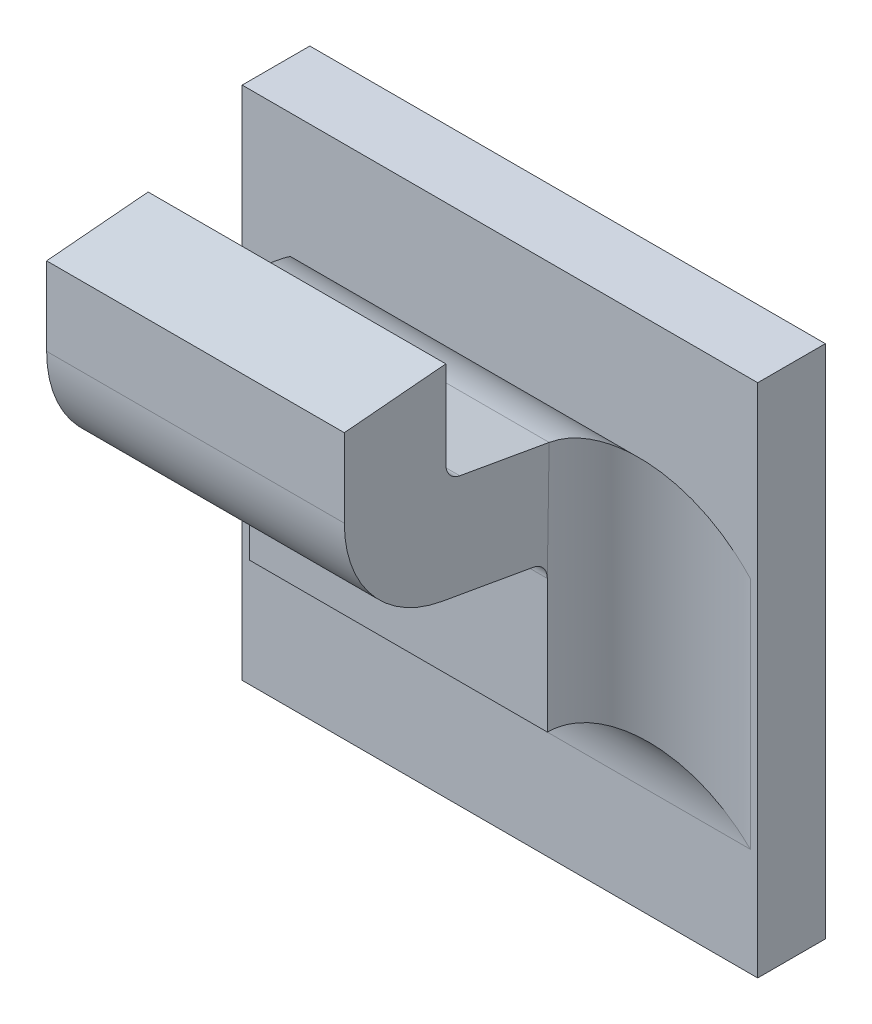
ISO-10303-21;
HEADER;
FILE_DESCRIPTION(('STEP AP214'),'2;1');
FILE_NAME('part.step','',(''),(''),'','','');
FILE_SCHEMA(('AUTOMOTIVE_DESIGN { 1 0 10303 214 1 1 1 1 }'));
ENDSEC;
DATA;
#1=APPLICATION_CONTEXT('core data for automotive mechanical design processes');
#2=APPLICATION_PROTOCOL_DEFINITION('international standard','automotive_design',2000,#1);
#3=PRODUCT_CONTEXT('',#1,'mechanical');
#4=PRODUCT('Part','Part','',(#3));
#5=PRODUCT_RELATED_PRODUCT_CATEGORY('part','',(#4));
#6=PRODUCT_DEFINITION_FORMATION('','',#4);
#7=PRODUCT_DEFINITION_CONTEXT('part definition',#1,'design');
#8=PRODUCT_DEFINITION('design','',#6,#7);
#9=PRODUCT_DEFINITION_SHAPE('','',#8);
#10=(LENGTH_UNIT() NAMED_UNIT(*) SI_UNIT(.MILLI.,.METRE.));
#11=(NAMED_UNIT(*) PLANE_ANGLE_UNIT() SI_UNIT($,.RADIAN.));
#12=(NAMED_UNIT(*) SI_UNIT($,.STERADIAN.) SOLID_ANGLE_UNIT());
#13=UNCERTAINTY_MEASURE_WITH_UNIT(LENGTH_MEASURE(1.E-05),#10,'distance_accuracy_value','');
#14=(GEOMETRIC_REPRESENTATION_CONTEXT(3) GLOBAL_UNCERTAINTY_ASSIGNED_CONTEXT((#13)) GLOBAL_UNIT_ASSIGNED_CONTEXT((#10,
#11,#12)) REPRESENTATION_CONTEXT('',''));
#15=CARTESIAN_POINT('',(0.,0.,0.));
#16=DIRECTION('',(0.,0.,1.));
#17=DIRECTION('',(1.,0.,0.));
#18=AXIS2_PLACEMENT_3D('',#15,#16,#17);
#19=CARTESIAN_POINT('',(-0.57698809134313,-0.481303520617574,0.0797273267071123));
#20=DIRECTION('',(1.,0.,0.));
#21=DIRECTION('',(0.,1.,0.));
#22=AXIS2_PLACEMENT_3D('',#19,#20,#21);
#23=CYLINDRICAL_SURFACE('',#22,0.00098425196850394);
#24=DIRECTION('',(1.,0.,0.));
#25=VECTOR('',#24,1.);
#26=CARTESIAN_POINT('',(-0.596043209453366,-0.481303520617574,0.0807115786756163));
#27=LINE('',#26,#25);
#28=CARTESIAN_POINT('',(-0.577854233075414,-0.481303520617574,0.0807115786756163));
#29=VERTEX_POINT('',#28);
#30=CARTESIAN_POINT('',(-0.595177067721083,-0.481303520617574,0.0807115786756163));
#31=VERTEX_POINT('',#30);
#32=EDGE_CURVE('E182',#29,#31,#27,.F.);
#33=ORIENTED_EDGE('',*,*,#32,.F.);
#34=CARTESIAN_POINT('',(-0.577854233075414,-0.481303520617574,0.0797273267071123));
#35=DIRECTION('',(1.,0.,0.));
#36=DIRECTION('',(0.,1.,0.));
#37=AXIS2_PLACEMENT_3D('',#34,#35,#36);
#38=CIRCLE('',#37,0.00098425196850394);
#39=CARTESIAN_POINT('',(-0.577854233075414,-0.482272819587074,0.0798982402678081));
#40=VERTEX_POINT('',#39);
#41=EDGE_CURVE('E155',#40,#29,#38,.F.);
#42=ORIENTED_EDGE('',*,*,#41,.F.);
#43=DIRECTION('',(1.,0.,0.));
#44=VECTOR('',#43,1.);
#45=CARTESIAN_POINT('',(-0.596047402238024,-0.482272819587074,0.0798982402678081));
#46=LINE('',#45,#44);
#47=CARTESIAN_POINT('',(-0.595177067721083,-0.482272819587074,0.0798982402678081));
#48=VERTEX_POINT('',#47);
#49=EDGE_CURVE('E137',#48,#40,#46,.T.);
#50=ORIENTED_EDGE('',*,*,#49,.F.);
#51=CARTESIAN_POINT('',(-0.595177067721083,-0.481303520617574,0.0797273267071123));
#52=DIRECTION('',(1.,0.,0.));
#53=DIRECTION('',(0.,1.,0.));
#54=AXIS2_PLACEMENT_3D('',#51,#52,#53);
#55=CIRCLE('',#54,0.00098425196850394);
#56=EDGE_CURVE('E148',#48,#31,#55,.F.);
#57=ORIENTED_EDGE('',*,*,#56,.T.);
#58=EDGE_LOOP('',(#33,#42,#50,#57));
#59=FACE_BOUND('',#58,.T.);
#60=ADVANCED_FACE('F17',(#59),#23,.F.);
#61=CARTESIAN_POINT('',(-0.596043209453366,-0.481557363411449,0.0807115786756163));
#62=DIRECTION('',(0.,0.,-1.));
#63=DIRECTION('',(0.,1.,0.));
#64=AXIS2_PLACEMENT_3D('',#61,#62,#63);
#65=PLANE('',#64);
#66=ORIENTED_EDGE('',*,*,#32,.T.);
#67=DIRECTION('',(0.,1.,0.));
#68=VECTOR('',#67,1.);
#69=CARTESIAN_POINT('',(-0.595177067721083,-0.490681533548079,0.0807115786756163));
#70=LINE('',#69,#68);
#71=CARTESIAN_POINT('',(-0.595177067721083,-0.476226664740066,0.0807115786756163));
#72=VERTEX_POINT('',#71);
#73=EDGE_CURVE('E177',#31,#72,#70,.T.);
#74=ORIENTED_EDGE('',*,*,#73,.T.);
#75=DIRECTION('',(1.,0.,0.));
#76=VECTOR('',#75,1.);
#77=CARTESIAN_POINT('',(-0.549015650398248,-0.476226664740067,0.0807115786756162));
#78=LINE('',#77,#76);
#79=CARTESIAN_POINT('',(-0.577854233075414,-0.476226664740066,0.0807115786756163));
#80=VERTEX_POINT('',#79);
#81=EDGE_CURVE('E170',#72,#80,#78,.T.);
#82=ORIENTED_EDGE('',*,*,#81,.T.);
#83=DIRECTION('',(0.,1.,0.));
#84=VECTOR('',#83,1.);
#85=CARTESIAN_POINT('',(-0.577854233075414,-0.490681533548079,0.0807115786756163));
#86=LINE('',#85,#84);
#87=EDGE_CURVE('E189',#29,#80,#86,.T.);
#88=ORIENTED_EDGE('',*,*,#87,.F.);
#89=EDGE_LOOP('',(#66,#74,#82,#88));
#90=FACE_BOUND('',#89,.T.);
#91=ADVANCED_FACE('F376',(#90),#65,.T.);
#92=CARTESIAN_POINT('',(-0.549015650398248,-0.476585262158006,0.0848103659183002));
#93=DIRECTION('',(0.,-0.996194698091746,-0.0871557427476516));
#94=DIRECTION('',(0.,0.0871557427476516,-0.996194698091746));
#95=AXIS2_PLACEMENT_3D('',#92,#93,#94);
#96=PLANE('',#95);
#97=DIRECTION('',(0.,-0.0871557427476615,0.996194698091745));
#98=VECTOR('',#97,1.);
#99=CARTESIAN_POINT('',(-0.595177067721083,-0.476226664740066,0.0807115786756163));
#100=LINE('',#99,#98);
#101=CARTESIAN_POINT('',(-0.595177067721083,-0.476743330075849,0.08661709048664));
#102=VERTEX_POINT('',#101);
#103=EDGE_CURVE('E173',#72,#102,#100,.T.);
#104=ORIENTED_EDGE('',*,*,#103,.T.);
#105=DIRECTION('',(1.,0.,0.));
#106=VECTOR('',#105,1.);
#107=CARTESIAN_POINT('',(-0.596043209453366,-0.476743330075849,0.0866170904866399));
#108=LINE('',#107,#106);
#109=CARTESIAN_POINT('',(-0.577854233075414,-0.476743330075849,0.0866170904866399));
#110=VERTEX_POINT('',#109);
#111=EDGE_CURVE('E167',#102,#110,#108,.T.);
#112=ORIENTED_EDGE('',*,*,#111,.T.);
#113=DIRECTION('',(0.,-0.0871557427476615,0.996194698091745));
#114=VECTOR('',#113,1.);
#115=CARTESIAN_POINT('',(-0.577854233075414,-0.476226664740066,0.0807115786756163));
#116=LINE('',#115,#114);
#117=EDGE_CURVE('E186',#80,#110,#116,.T.);
#118=ORIENTED_EDGE('',*,*,#117,.F.);
#119=ORIENTED_EDGE('',*,*,#81,.F.);
#120=EDGE_LOOP('',(#104,#112,#118,#119));
#121=FACE_BOUND('',#120,.T.);
#122=ADVANCED_FACE('F380',(#121),#96,.F.);
#123=CARTESIAN_POINT('',(-0.596043209453366,-0.48153153014466,0.0866170904866399));
#124=DIRECTION('',(0.,0.,-1.));
#125=DIRECTION('',(0.,1.,0.));
#126=AXIS2_PLACEMENT_3D('',#123,#124,#125);
#127=PLANE('',#126);
#128=ORIENTED_EDGE('',*,*,#111,.F.);
#129=DIRECTION('',(0.,1.,0.));
#130=VECTOR('',#129,1.);
#131=CARTESIAN_POINT('',(-0.595177067721083,-0.490681533548079,0.08661709048664));
#132=LINE('',#131,#130);
#133=CARTESIAN_POINT('',(-0.595177067721083,-0.481303520617574,0.0866170904866399));
#134=VERTEX_POINT('',#133);
#135=EDGE_CURVE('E176',#102,#134,#132,.F.);
#136=ORIENTED_EDGE('',*,*,#135,.T.);
#137=DIRECTION('',(1.,0.,0.));
#138=VECTOR('',#137,1.);
#139=CARTESIAN_POINT('',(-0.57698809134313,-0.481303520617574,0.0866170904866399));
#140=LINE('',#139,#138);
#141=CARTESIAN_POINT('',(-0.577854233075414,-0.481303520617574,0.0866170904866399));
#142=VERTEX_POINT('',#141);
#143=EDGE_CURVE('E165',#142,#134,#140,.F.);
#144=ORIENTED_EDGE('',*,*,#143,.F.);
#145=DIRECTION('',(0.,1.,0.));
#146=VECTOR('',#145,1.);
#147=CARTESIAN_POINT('',(-0.577854233075414,-0.490681533548079,0.08661709048664));
#148=LINE('',#147,#146);
#149=EDGE_CURVE('E188',#110,#142,#148,.F.);
#150=ORIENTED_EDGE('',*,*,#149,.F.);
#151=EDGE_LOOP('',(#128,#136,#144,#150));
#152=FACE_BOUND('',#151,.T.);
#153=ADVANCED_FACE('F384',(#152),#127,.F.);
#154=CARTESIAN_POINT('',(-0.57698809134313,-0.481303520617574,0.0797273267071123));
#155=DIRECTION('',(1.,0.,0.));
#156=DIRECTION('',(0.,1.,0.));
#157=AXIS2_PLACEMENT_3D('',#154,#155,#156);
#158=CYLINDRICAL_SURFACE('',#157,0.00688976377952756);
#159=CARTESIAN_POINT('',(-0.577854233075414,-0.481303520617574,0.0797273267071123));
#160=DIRECTION('',(1.,0.,0.));
#161=DIRECTION('',(0.,1.,0.));
#162=AXIS2_PLACEMENT_3D('',#159,#160,#161);
#163=CIRCLE('',#162,0.00688976377952756);
#164=CARTESIAN_POINT('',(-0.577854233075414,-0.488088613404075,0.0809237216319831));
#165=VERTEX_POINT('',#164);
#166=EDGE_CURVE('E146',#142,#165,#163,.T.);
#167=ORIENTED_EDGE('',*,*,#166,.F.);
#168=ORIENTED_EDGE('',*,*,#143,.T.);
#169=CARTESIAN_POINT('',(-0.595177067721083,-0.481303520617574,0.0797273267071123));
#170=DIRECTION('',(1.,0.,0.));
#171=DIRECTION('',(0.,1.,0.));
#172=AXIS2_PLACEMENT_3D('',#169,#170,#171);
#173=CIRCLE('',#172,0.00688976377952756);
#174=CARTESIAN_POINT('',(-0.595177067721083,-0.488088613404075,0.0809237216319831));
#175=VERTEX_POINT('',#174);
#176=EDGE_CURVE('E235',#134,#175,#173,.T.);
#177=ORIENTED_EDGE('',*,*,#176,.T.);
#178=DIRECTION('',(1.,0.,0.));
#179=VECTOR('',#178,1.);
#180=CARTESIAN_POINT('',(-0.596043209453366,-0.488088613404075,0.0809237216319829));
#181=LINE('',#180,#179);
#182=EDGE_CURVE('E138',#175,#165,#181,.T.);
#183=ORIENTED_EDGE('',*,*,#182,.T.);
#184=EDGE_LOOP('',(#167,#168,#177,#183));
#185=FACE_BOUND('',#184,.T.);
#186=ADVANCED_FACE('F388',(#185),#158,.T.);
#187=CARTESIAN_POINT('',(-0.596043209453366,-0.489070672196903,0.0753541894544217));
#188=DIRECTION('',(0.,0.984807753012208,-0.17364817766693));
#189=DIRECTION('',(0.,0.17364817766693,0.984807753012208));
#190=AXIS2_PLACEMENT_3D('',#187,#188,#189);
#191=PLANE('',#190);
#192=DIRECTION('',(1.,0.,0.));
#193=VECTOR('',#192,1.);
#194=CARTESIAN_POINT('',(-0.57698809134313,-0.489023907492483,0.0756194052724008));
#195=LINE('',#194,#193);
#196=CARTESIAN_POINT('',(-0.595177067721083,-0.489023907492483,0.0756194052724008));
#197=VERTEX_POINT('',#196);
#198=CARTESIAN_POINT('',(-0.577854233075414,-0.489023907492483,0.0756194052724008));
#199=VERTEX_POINT('',#198);
#200=EDGE_CURVE('E127',#197,#199,#195,.T.);
#201=ORIENTED_EDGE('',*,*,#200,.T.);
#202=DIRECTION('',(0.,-0.173648177666989,-0.984807753012198));
#203=VECTOR('',#202,1.);
#204=CARTESIAN_POINT('',(-0.577854233075414,-0.488088613404075,0.0809237216319829));
#205=LINE('',#204,#203);
#206=EDGE_CURVE('E130',#165,#199,#205,.T.);
#207=ORIENTED_EDGE('',*,*,#206,.F.);
#208=ORIENTED_EDGE('',*,*,#182,.F.);
#209=DIRECTION('',(0.,-0.173648177666989,-0.984807753012198));
#210=VECTOR('',#209,1.);
#211=CARTESIAN_POINT('',(-0.595177067721083,-0.488088613404075,0.0809237216319829));
#212=LINE('',#211,#210);
#213=EDGE_CURVE('E132',#175,#197,#212,.T.);
#214=ORIENTED_EDGE('',*,*,#213,.T.);
#215=EDGE_LOOP('',(#201,#207,#208,#214));
#216=FACE_BOUND('',#215,.T.);
#217=ADVANCED_FACE('F129',(#216),#191,.F.);
#218=CARTESIAN_POINT('',(-0.57698809134313,-0.489993206461983,0.0757903188330966));
#219=DIRECTION('',(1.,0.,0.));
#220=DIRECTION('',(0.,1.,0.));
#221=AXIS2_PLACEMENT_3D('',#218,#219,#220);
#222=CYLINDRICAL_SURFACE('',#221,0.00098425196850394);
#223=DIRECTION('',(1.,0.,0.));
#224=VECTOR('',#223,1.);
#225=CARTESIAN_POINT('',(-0.596043209453366,-0.489993206461983,0.0748060668645926));
#226=LINE('',#225,#224);
#227=CARTESIAN_POINT('',(-0.595177067721083,-0.489993206461983,0.0748060668645927));
#228=VERTEX_POINT('',#227);
#229=CARTESIAN_POINT('',(-0.577854233075414,-0.489993206461983,0.0748060668645926));
#230=VERTEX_POINT('',#229);
#231=EDGE_CURVE('E151',#228,#230,#226,.T.);
#232=ORIENTED_EDGE('',*,*,#231,.T.);
#233=CARTESIAN_POINT('',(-0.577854233075414,-0.489993206461983,0.0757903188330966));
#234=DIRECTION('',(1.,0.,0.));
#235=DIRECTION('',(0.,1.,0.));
#236=AXIS2_PLACEMENT_3D('',#233,#234,#235);
#237=CIRCLE('',#236,0.00098425196850394);
#238=EDGE_CURVE('E20',#199,#230,#237,.F.);
#239=ORIENTED_EDGE('',*,*,#238,.F.);
#240=ORIENTED_EDGE('',*,*,#200,.F.);
#241=CARTESIAN_POINT('',(-0.595177067721083,-0.489993206461983,0.0757903188330966));
#242=DIRECTION('',(1.,0.,0.));
#243=DIRECTION('',(0.,1.,0.));
#244=AXIS2_PLACEMENT_3D('',#241,#242,#243);
#245=CIRCLE('',#244,0.00098425196850394);
#246=EDGE_CURVE('E232',#197,#228,#245,.F.);
#247=ORIENTED_EDGE('',*,*,#246,.T.);
#248=EDGE_LOOP('',(#232,#239,#240,#247));
#249=FACE_BOUND('',#248,.T.);
#250=ADVANCED_FACE('F150',(#249),#222,.F.);
#251=CARTESIAN_POINT('',(-0.596047402238024,-0.483254878379902,0.0743287080902469));
#252=DIRECTION('',(0.,0.984807753012208,-0.17364817766693));
#253=DIRECTION('',(0.,0.17364817766693,0.984807753012208));
#254=AXIS2_PLACEMENT_3D('',#251,#252,#253);
#255=PLANE('',#254);
#256=DIRECTION('',(0.,0.173648177666938,0.984807753012207));
#257=VECTOR('',#256,1.);
#258=CARTESIAN_POINT('',(-0.577854233075414,-0.483170707148507,0.0748060668645927));
#259=LINE('',#258,#257);
#260=CARTESIAN_POINT('',(-0.577852327264205,-0.483189410411994,0.0746999953864093));
#261=VERTEX_POINT('',#260);
#262=EDGE_CURVE('E153',#261,#40,#259,.T.);
#263=ORIENTED_EDGE('',*,*,#262,.F.);
#264=DIRECTION('',(1.,0.,0.));
#265=VECTOR('',#264,1.);
#266=CARTESIAN_POINT('',(-0.570492028351004,-0.483208113675482,0.0745939239082259));
#267=LINE('',#266,#265);
#268=CARTESIAN_POINT('',(-0.595178973532291,-0.483189410411994,0.0746999953864093));
#269=VERTEX_POINT('',#268);
#270=EDGE_CURVE('E264',#269,#261,#267,.T.);
#271=ORIENTED_EDGE('',*,*,#270,.F.);
#272=DIRECTION('',(0.,0.173648177666938,0.984807753012207));
#273=VECTOR('',#272,1.);
#274=CARTESIAN_POINT('',(-0.595177067721083,-0.483170707148507,0.0748060668645927));
#275=LINE('',#274,#273);
#276=EDGE_CURVE('E234',#269,#48,#275,.T.);
#277=ORIENTED_EDGE('',*,*,#276,.T.);
#278=ORIENTED_EDGE('',*,*,#49,.T.);
#279=EDGE_LOOP('',(#263,#271,#277,#278));
#280=FACE_BOUND('',#279,.T.);
#281=ADVANCED_FACE('F373',(#280),#255,.T.);
#282=CARTESIAN_POINT('',(-0.577854233075414,-0.490681533548079,0.0742155156834903));
#283=DIRECTION('',(1.,0.,0.));
#284=DIRECTION('',(0.,1.,0.));
#285=AXIS2_PLACEMENT_3D('',#282,#283,#284);
#286=PLANE('',#285);
#287=ORIENTED_EDGE('',*,*,#166,.T.);
#288=ORIENTED_EDGE('',*,*,#206,.T.);
#289=ORIENTED_EDGE('',*,*,#238,.T.);
#290=DIRECTION('',(0.,-1.,0.));
#291=VECTOR('',#290,1.);
#292=CARTESIAN_POINT('',(-0.577854233075414,-0.504665225306676,0.0748060668645926));
#293=LINE('',#292,#291);
#294=EDGE_CURVE('E271',#230,#261,#293,.F.);
#295=ORIENTED_EDGE('',*,*,#294,.T.);
#296=ORIENTED_EDGE('',*,*,#262,.T.);
#297=ORIENTED_EDGE('',*,*,#41,.T.);
#298=ORIENTED_EDGE('',*,*,#87,.T.);
#299=ORIENTED_EDGE('',*,*,#117,.T.);
#300=ORIENTED_EDGE('',*,*,#149,.T.);
#301=EDGE_LOOP('',(#287,#288,#289,#295,#296,#297,#298,#299,#300));
#302=FACE_BOUND('',#301,.T.);
#303=ADVANCED_FACE('F142',(#302),#286,.T.);
#304=CARTESIAN_POINT('',(-0.595177067721083,-0.490681533548079,0.0742155156834903));
#305=DIRECTION('',(1.,0.,0.));
#306=DIRECTION('',(0.,1.,0.));
#307=AXIS2_PLACEMENT_3D('',#304,#305,#306);
#308=PLANE('',#307);
#309=DIRECTION('',(0.,1.,0.));
#310=VECTOR('',#309,1.);
#311=CARTESIAN_POINT('',(-0.595177067721082,-0.482147158664785,0.0748060668645927));
#312=LINE('',#311,#310);
#313=EDGE_CURVE('E290',#269,#228,#312,.F.);
#314=ORIENTED_EDGE('',*,*,#313,.T.);
#315=ORIENTED_EDGE('',*,*,#246,.F.);
#316=ORIENTED_EDGE('',*,*,#213,.F.);
#317=ORIENTED_EDGE('',*,*,#176,.F.);
#318=ORIENTED_EDGE('',*,*,#135,.F.);
#319=ORIENTED_EDGE('',*,*,#103,.F.);
#320=ORIENTED_EDGE('',*,*,#73,.F.);
#321=ORIENTED_EDGE('',*,*,#56,.F.);
#322=ORIENTED_EDGE('',*,*,#276,.F.);
#323=EDGE_LOOP('',(#314,#315,#316,#317,#318,#319,#320,#321,#322));
#324=FACE_BOUND('',#323,.T.);
#325=ADVANCED_FACE('F371',(#324),#308,.F.);
#326=CARTESIAN_POINT('',(-0.596043209453366,-0.498123312939428,0.0748060668645926));
#327=DIRECTION('',(0.,0.,-1.));
#328=DIRECTION('',(0.,1.,0.));
#329=AXIS2_PLACEMENT_3D('',#326,#327,#328);
#330=PLANE('',#329);
#331=DIRECTION('',(-1.,0.,0.));
#332=VECTOR('',#331,1.);
#333=CARTESIAN_POINT('',(-0.602539272445492,-0.49773616501193,0.0748060668645926));
#334=LINE('',#333,#332);
#335=CARTESIAN_POINT('',(-0.595177067721082,-0.49773616501193,0.0748060668645926));
#336=VERTEX_POINT('',#335);
#337=CARTESIAN_POINT('',(-0.577854233075414,-0.49773616501193,0.0748060668645926));
#338=VERTEX_POINT('',#337);
#339=EDGE_CURVE('E275',#336,#338,#334,.F.);
#340=ORIENTED_EDGE('',*,*,#339,.T.);
#341=DIRECTION('',(0.,-1.,0.));
#342=VECTOR('',#341,1.);
#343=CARTESIAN_POINT('',(-0.577854233075414,-0.504665225306676,0.0748060668645926));
#344=LINE('',#343,#342);
#345=EDGE_CURVE('E268',#338,#230,#344,.F.);
#346=ORIENTED_EDGE('',*,*,#345,.T.);
#347=ORIENTED_EDGE('',*,*,#231,.F.);
#348=DIRECTION('',(0.,1.,0.));
#349=VECTOR('',#348,1.);
#350=CARTESIAN_POINT('',(-0.595177067721082,-0.482147158664785,0.0748060668645926));
#351=LINE('',#350,#349);
#352=EDGE_CURVE('E293',#228,#336,#351,.F.);
#353=ORIENTED_EDGE('',*,*,#352,.T.);
#354=EDGE_LOOP('',(#340,#346,#347,#353));
#355=FACE_BOUND('',#354,.T.);
#356=ADVANCED_FACE('F369',(#355),#330,.F.);
#357=CARTESIAN_POINT('',(-0.570492028351004,-0.489993206461983,0.0757903188330966));
#358=DIRECTION('',(1.,0.,0.));
#359=DIRECTION('',(0.,1.,0.));
#360=AXIS2_PLACEMENT_3D('',#357,#358,#359);
#361=CYLINDRICAL_SURFACE('',#360,0.00688976377952756);
#362=ORIENTED_EDGE('',*,*,#270,.T.);
#363=CARTESIAN_POINT('',(-0.577853227099265,-0.483190299054108,0.0747001216257358));
#364=CARTESIAN_POINT('',(-0.577848327751098,-0.483237076502032,0.074405223433363));
#365=CARTESIAN_POINT('',(-0.577820725120362,-0.48330363441383,0.074115034151789));
#366=CARTESIAN_POINT('',(-0.577726784768239,-0.48347014964807,0.073553844729337));
#367=CARTESIAN_POINT('',(-0.577660815248929,-0.483569785675541,0.0732826892737776));
#368=CARTESIAN_POINT('',(-0.577496831530718,-0.483796900902092,0.0727646055784551));
#369=CARTESIAN_POINT('',(-0.577398954406138,-0.48392426023827,0.0725175794773051));
#370=CARTESIAN_POINT('',(-0.577177352949507,-0.484201625658181,0.0720485533086557));
#371=CARTESIAN_POINT('',(-0.577053561864929,-0.484351689945956,0.0718266201983145));
#372=CARTESIAN_POINT('',(-0.57671729390458,-0.484750708379493,0.0713022915327615));
#373=CARTESIAN_POINT('',(-0.57649184432977,-0.485010979657895,0.0710168133445037));
#374=CARTESIAN_POINT('',(-0.576009767700218,-0.485558615462719,0.0705040567027229));
#375=CARTESIAN_POINT('',(-0.575753069178619,-0.485846041744032,0.0702769154978245));
#376=CARTESIAN_POINT('',(-0.575119018974546,-0.486549705339456,0.0698026326616957));
#377=CARTESIAN_POINT('',(-0.574732430345045,-0.486973936440458,0.0695797433223628));
#378=CARTESIAN_POINT('',(-0.573938574176521,-0.487840056506252,0.0692289934880922));
#379=CARTESIAN_POINT('',(-0.573531322381542,-0.488281931974037,0.0691010617693635));
#380=CARTESIAN_POINT('',(-0.572849654493482,-0.489019814551546,0.0689631980798834));
#381=CARTESIAN_POINT('',(-0.572577774613566,-0.489313668588468,0.0689278051732856));
#382=CARTESIAN_POINT('',(-0.572186541195021,-0.4897363315112,0.0689041494171859));
#383=CARTESIAN_POINT('',(-0.57206762576773,-0.489864774668986,0.068900564537093));
#384=CARTESIAN_POINT('',(-0.57194872126439,-0.489993206461983,0.068900555053569));
#385=B_SPLINE_CURVE_WITH_KNOTS('',3,(#363,#364,#365,#366,#367,#368,#369,#370,#371,#372,#373,
#374,#375,#376,#377,#378,#379,#380,#381,#382,#383,#384),.UNSPECIFIED.,.F.,.F.,(4,2,2,2,2,2,2,2,
2,2,4),(0.,0.000892674275674716,0.00177691981761758,0.00265741564566993,0.00354020811045541,
0.00487460341316201,0.00621210995073977,0.00804949445936699,0.00988549942521273,
0.0110894312839999,0.0116145091100795),.UNSPECIFIED.);
#386=CARTESIAN_POINT('',(-0.57194872126439,-0.489993206461983,0.068900555053569));
#387=VERTEX_POINT('',#386);
#388=EDGE_CURVE('E231',#261,#387,#385,.T.);
#389=ORIENTED_EDGE('',*,*,#388,.T.);
#390=DIRECTION('',(1.,0.,0.));
#391=VECTOR('',#390,1.);
#392=CARTESIAN_POINT('',(-0.603015650398248,-0.489993206461983,0.068900555053569));
#393=LINE('',#392,#391);
#394=CARTESIAN_POINT('',(-0.601082579532106,-0.489993206461983,0.068900555053569));
#395=VERTEX_POINT('',#394);
#396=EDGE_CURVE('E195',#395,#387,#393,.T.);
#397=ORIENTED_EDGE('',*,*,#396,.F.);
#398=CARTESIAN_POINT('',(-0.595178073697232,-0.483190299054108,0.0747001216257358));
#399=CARTESIAN_POINT('',(-0.595182973045398,-0.483237076502032,0.074405223433363));
#400=CARTESIAN_POINT('',(-0.595210575676134,-0.48330363441383,0.074115034151789));
#401=CARTESIAN_POINT('',(-0.595304516028257,-0.483470149648069,0.0735538447293369));
#402=CARTESIAN_POINT('',(-0.595370485547567,-0.483569785675541,0.0732826892737776));
#403=CARTESIAN_POINT('',(-0.595534469265778,-0.483796900902092,0.0727646055784551));
#404=CARTESIAN_POINT('',(-0.595632346390358,-0.48392426023827,0.0725175794773051));
#405=CARTESIAN_POINT('',(-0.595853947846989,-0.484201625658181,0.0720485533086557));
#406=CARTESIAN_POINT('',(-0.595977738931567,-0.484351689945956,0.0718266201983145));
#407=CARTESIAN_POINT('',(-0.596314006891916,-0.484750708379493,0.0713022915327615));
#408=CARTESIAN_POINT('',(-0.596539456466726,-0.485010979657894,0.0710168133445037));
#409=CARTESIAN_POINT('',(-0.597021533096278,-0.485558615462719,0.070504056702723));
#410=CARTESIAN_POINT('',(-0.597278231617877,-0.485846041744032,0.0702769154978245));
#411=CARTESIAN_POINT('',(-0.59791228182195,-0.486549705339456,0.0698026326616957));
#412=CARTESIAN_POINT('',(-0.598298870451451,-0.486973936440458,0.0695797433223628));
#413=CARTESIAN_POINT('',(-0.599092726619975,-0.487840056506252,0.0692289934880922));
#414=CARTESIAN_POINT('',(-0.599499978414954,-0.488281931974037,0.0691010617693635));
#415=CARTESIAN_POINT('',(-0.600181646303014,-0.489019814551546,0.0689631980798835));
#416=CARTESIAN_POINT('',(-0.600453526182931,-0.489313668588467,0.0689278051732857));
#417=CARTESIAN_POINT('',(-0.600844759601475,-0.489736331511199,0.0689041494171859));
#418=CARTESIAN_POINT('',(-0.600963675028766,-0.489864774668985,0.0689005645370931));
#419=CARTESIAN_POINT('',(-0.601082579532106,-0.489993206461983,0.0689005550535691));
#420=B_SPLINE_CURVE_WITH_KNOTS('',3,(#398,#399,#400,#401,#402,#403,#404,#405,#406,#407,#408,
#409,#410,#411,#412,#413,#414,#415,#416,#417,#418,#419),.UNSPECIFIED.,.F.,.F.,(4,2,2,2,2,2,2,2,
2,2,4),(0.,0.000892674275674719,0.00177691981761757,0.00265741564566992,0.00354020811045541,
0.00487460341316188,0.00621210995073982,0.00804949445936695,0.00988549942521279,
0.0110894312839998,0.0116145091100794),.UNSPECIFIED.);
#421=EDGE_CURVE('E192',#395,#269,#420,.F.);
#422=ORIENTED_EDGE('',*,*,#421,.T.);
#423=EDGE_LOOP('',(#362,#389,#397,#422));
#424=FACE_BOUND('',#423,.T.);
#425=ADVANCED_FACE('F205',(#424),#361,.T.);
#426=CARTESIAN_POINT('',(-0.57194872126439,-0.504665225306676,0.0748060668645926));
#427=DIRECTION('',(0.,-1.,0.));
#428=DIRECTION('',(1.,0.,0.));
#429=AXIS2_PLACEMENT_3D('',#426,#427,#428);
#430=CYLINDRICAL_SURFACE('',#429,0.00590551181102362);
#431=ORIENTED_EDGE('',*,*,#345,.F.);
#432=CARTESIAN_POINT('',(-0.57194872126439,-0.503641676822954,0.0748060668645926));
#433=DIRECTION('',(-0.707106781186548,-0.707106781186547,0.));
#434=DIRECTION('',(0.707106781186547,-0.707106781186548,0.));
#435=AXIS2_PLACEMENT_3D('',#432,#433,#434);
#436=ELLIPSE('',#435,0.0083516548959041,0.00590551181102362);
#437=CARTESIAN_POINT('',(-0.57194872126439,-0.503641676822954,0.068900555053569));
#438=VERTEX_POINT('',#437);
#439=EDGE_CURVE('E281',#338,#438,#436,.T.);
#440=ORIENTED_EDGE('',*,*,#439,.T.);
#441=DIRECTION('',(0.,-1.,0.));
#442=VECTOR('',#441,1.);
#443=CARTESIAN_POINT('',(-0.57194872126439,-0.478412922297737,0.068900555053569));
#444=LINE('',#443,#442);
#445=EDGE_CURVE('E276',#387,#438,#444,.T.);
#446=ORIENTED_EDGE('',*,*,#445,.F.);
#447=ORIENTED_EDGE('',*,*,#388,.F.);
#448=ORIENTED_EDGE('',*,*,#294,.F.);
#449=EDGE_LOOP('',(#431,#440,#446,#447,#448));
#450=FACE_BOUND('',#449,.T.);
#451=ADVANCED_FACE('F219',(#450),#430,.F.);
#452=CARTESIAN_POINT('',(-0.602539272445492,-0.503641676822954,0.0748060668645926));
#453=DIRECTION('',(-1.,0.,0.));
#454=DIRECTION('',(0.,-1.,0.));
#455=AXIS2_PLACEMENT_3D('',#452,#453,#454);
#456=CYLINDRICAL_SURFACE('',#455,0.00590551181102362);
#457=DIRECTION('',(1.,0.,0.));
#458=VECTOR('',#457,1.);
#459=CARTESIAN_POINT('',(-0.603015650398248,-0.503641676822954,0.068900555053569));
#460=LINE('',#459,#458);
#461=CARTESIAN_POINT('',(-0.601082579532106,-0.503641676822954,0.068900555053569));
#462=VERTEX_POINT('',#461);
#463=EDGE_CURVE('E278',#438,#462,#460,.F.);
#464=ORIENTED_EDGE('',*,*,#463,.F.);
#465=ORIENTED_EDGE('',*,*,#439,.F.);
#466=ORIENTED_EDGE('',*,*,#339,.F.);
#467=CARTESIAN_POINT('',(-0.601082579532106,-0.503641676822954,0.0748060668645927));
#468=DIRECTION('',(-0.707106781186547,0.707106781186548,0.));
#469=DIRECTION('',(-0.707106781186548,-0.707106781186547,0.));
#470=AXIS2_PLACEMENT_3D('',#467,#468,#469);
#471=ELLIPSE('',#470,0.0083516548959041,0.00590551181102362);
#472=EDGE_CURVE('E196',#336,#462,#471,.T.);
#473=ORIENTED_EDGE('',*,*,#472,.T.);
#474=EDGE_LOOP('',(#464,#465,#466,#473));
#475=FACE_BOUND('',#474,.T.);
#476=ADVANCED_FACE('F215',(#475),#456,.F.);
#477=CARTESIAN_POINT('',(-0.601082579532106,-0.482147158664785,0.0748060668645927));
#478=DIRECTION('',(0.,1.,0.));
#479=DIRECTION('',(-1.,0.,0.));
#480=AXIS2_PLACEMENT_3D('',#477,#478,#479);
#481=CYLINDRICAL_SURFACE('',#480,0.00590551181102362);
#482=DIRECTION('',(0.,-1.,0.));
#483=VECTOR('',#482,1.);
#484=CARTESIAN_POINT('',(-0.601082579532106,-0.478412922297737,0.068900555053569));
#485=LINE('',#484,#483);
#486=EDGE_CURVE('E283',#462,#395,#485,.F.);
#487=ORIENTED_EDGE('',*,*,#486,.F.);
#488=ORIENTED_EDGE('',*,*,#472,.F.);
#489=ORIENTED_EDGE('',*,*,#352,.F.);
#490=ORIENTED_EDGE('',*,*,#313,.F.);
#491=ORIENTED_EDGE('',*,*,#421,.F.);
#492=EDGE_LOOP('',(#487,#488,#489,#490,#491));
#493=FACE_BOUND('',#492,.T.);
#494=ADVANCED_FACE('F209',(#493),#481,.F.);
#495=CARTESIAN_POINT('',(-0.603015650398248,-0.478412922297737,0.068900555053569));
#496=DIRECTION('',(0.,0.,1.));
#497=DIRECTION('',(0.,-1.,0.));
#498=AXIS2_PLACEMENT_3D('',#495,#496,#497);
#499=PLANE('',#498);
#500=ORIENTED_EDGE('',*,*,#463,.T.);
#501=ORIENTED_EDGE('',*,*,#486,.T.);
#502=ORIENTED_EDGE('',*,*,#396,.T.);
#503=ORIENTED_EDGE('',*,*,#445,.T.);
#504=EDGE_LOOP('',(#500,#501,#502,#503));
#505=FACE_BOUND('',#504,.T.);
#506=DIRECTION('',(0.,-1.,0.));
#507=VECTOR('',#506,1.);
#508=CARTESIAN_POINT('',(-0.571515650398248,-0.478412922297737,0.068900555053569));
#509=LINE('',#508,#507);
#510=CARTESIAN_POINT('',(-0.571515650398248,-0.509912922297737,0.068900555053569));
#511=VERTEX_POINT('',#510);
#512=CARTESIAN_POINT('',(-0.571515650398248,-0.479912922297737,0.068900555053569));
#513=VERTEX_POINT('',#512);
#514=EDGE_CURVE('E300',#511,#513,#509,.F.);
#515=ORIENTED_EDGE('',*,*,#514,.T.);
#516=DIRECTION('',(1.,0.,0.));
#517=VECTOR('',#516,1.);
#518=CARTESIAN_POINT('',(-0.603015650398248,-0.479912922297737,0.068900555053569));
#519=LINE('',#518,#517);
#520=CARTESIAN_POINT('',(-0.601515650398248,-0.479912922297737,0.068900555053569));
#521=VERTEX_POINT('',#520);
#522=EDGE_CURVE('E305',#513,#521,#519,.F.);
#523=ORIENTED_EDGE('',*,*,#522,.T.);
#524=DIRECTION('',(0.,1.,0.));
#525=VECTOR('',#524,1.);
#526=CARTESIAN_POINT('',(-0.601515650398248,-0.511412922297737,0.068900555053569));
#527=LINE('',#526,#525);
#528=CARTESIAN_POINT('',(-0.601515650398248,-0.509912922297737,0.068900555053569));
#529=VERTEX_POINT('',#528);
#530=EDGE_CURVE('E308',#521,#529,#527,.F.);
#531=ORIENTED_EDGE('',*,*,#530,.T.);
#532=DIRECTION('',(-1.,0.,0.));
#533=VECTOR('',#532,1.);
#534=CARTESIAN_POINT('',(-0.570015650398248,-0.509912922297737,0.068900555053569));
#535=LINE('',#534,#533);
#536=EDGE_CURVE('E286',#529,#511,#535,.F.);
#537=ORIENTED_EDGE('',*,*,#536,.T.);
#538=EDGE_LOOP('',(#515,#523,#531,#537));
#539=FACE_BOUND('',#538,.T.);
#540=ADVANCED_FACE('F214',(#505,#539),#499,.T.);
#541=CARTESIAN_POINT('',(-0.570015650398248,-0.509912922297737,0.0647666967858525));
#542=DIRECTION('',(0.,1.,0.));
#543=DIRECTION('',(-1.,0.,0.));
#544=AXIS2_PLACEMENT_3D('',#541,#542,#543);
#545=PLANE('',#544);
#546=DIRECTION('',(0.,0.,1.));
#547=VECTOR('',#546,1.);
#548=CARTESIAN_POINT('',(-0.571515650398248,-0.509912922297737,0.0647666967858525));
#549=LINE('',#548,#547);
#550=CARTESIAN_POINT('',(-0.571515650398248,-0.509912922297737,0.0649635471795533));
#551=VERTEX_POINT('',#550);
#552=EDGE_CURVE('E297',#551,#511,#549,.T.);
#553=ORIENTED_EDGE('',*,*,#552,.T.);
#554=ORIENTED_EDGE('',*,*,#536,.F.);
#555=DIRECTION('',(0.,0.,1.));
#556=VECTOR('',#555,1.);
#557=CARTESIAN_POINT('',(-0.601515650398248,-0.509912922297737,0.0647666967858525));
#558=LINE('',#557,#556);
#559=CARTESIAN_POINT('',(-0.601515650398248,-0.509912922297737,0.0649635471795533));
#560=VERTEX_POINT('',#559);
#561=EDGE_CURVE('E311',#529,#560,#558,.F.);
#562=ORIENTED_EDGE('',*,*,#561,.T.);
#563=DIRECTION('',(1.,0.,0.));
#564=VECTOR('',#563,1.);
#565=CARTESIAN_POINT('',(-0.603015650398248,-0.509912922297737,0.0649635471795533));
#566=LINE('',#565,#564);
#567=EDGE_CURVE('E314',#560,#551,#566,.T.);
#568=ORIENTED_EDGE('',*,*,#567,.T.);
#569=EDGE_LOOP('',(#553,#554,#562,#568));
#570=FACE_BOUND('',#569,.T.);
#571=ADVANCED_FACE('F332',(#570),#545,.F.);
#572=CARTESIAN_POINT('',(-0.571515650398248,-0.478412922297737,0.0647666967858525));
#573=DIRECTION('',(-1.,0.,0.));
#574=DIRECTION('',(0.,-1.,0.));
#575=AXIS2_PLACEMENT_3D('',#572,#573,#574);
#576=PLANE('',#575);
#577=DIRECTION('',(0.,0.,1.));
#578=VECTOR('',#577,1.);
#579=CARTESIAN_POINT('',(-0.571515650398248,-0.479912922297737,0.0647666967858525));
#580=LINE('',#579,#578);
#581=CARTESIAN_POINT('',(-0.571515650398248,-0.479912922297737,0.0649635471795533));
#582=VERTEX_POINT('',#581);
#583=EDGE_CURVE('E302',#582,#513,#580,.T.);
#584=ORIENTED_EDGE('',*,*,#583,.T.);
#585=ORIENTED_EDGE('',*,*,#514,.F.);
#586=ORIENTED_EDGE('',*,*,#552,.F.);
#587=DIRECTION('',(0.,-1.,0.));
#588=VECTOR('',#587,1.);
#589=CARTESIAN_POINT('',(-0.571515650398248,-0.478412922297737,0.0649635471795533));
#590=LINE('',#589,#588);
#591=EDGE_CURVE('E317',#551,#582,#590,.F.);
#592=ORIENTED_EDGE('',*,*,#591,.T.);
#593=EDGE_LOOP('',(#584,#585,#586,#592));
#594=FACE_BOUND('',#593,.T.);
#595=ADVANCED_FACE('F329',(#594),#576,.F.);
#596=CARTESIAN_POINT('',(-0.603015650398248,-0.479912922297737,0.0647666967858525));
#597=DIRECTION('',(0.,-1.,0.));
#598=DIRECTION('',(1.,0.,0.));
#599=AXIS2_PLACEMENT_3D('',#596,#597,#598);
#600=PLANE('',#599);
#601=DIRECTION('',(0.,0.,1.));
#602=VECTOR('',#601,1.);
#603=CARTESIAN_POINT('',(-0.601515650398248,-0.479912922297737,0.0647666967858525));
#604=LINE('',#603,#602);
#605=CARTESIAN_POINT('',(-0.601515650398248,-0.479912922297737,0.0649635471795533));
#606=VERTEX_POINT('',#605);
#607=EDGE_CURVE('E34',#606,#521,#604,.T.);
#608=ORIENTED_EDGE('',*,*,#607,.T.);
#609=ORIENTED_EDGE('',*,*,#522,.F.);
#610=ORIENTED_EDGE('',*,*,#583,.F.);
#611=DIRECTION('',(1.,0.,0.));
#612=VECTOR('',#611,1.);
#613=CARTESIAN_POINT('',(-0.603015650398248,-0.479912922297737,0.0649635471795533));
#614=LINE('',#613,#612);
#615=EDGE_CURVE('E26',#582,#606,#614,.F.);
#616=ORIENTED_EDGE('',*,*,#615,.T.);
#617=EDGE_LOOP('',(#608,#609,#610,#616));
#618=FACE_BOUND('',#617,.T.);
#619=ADVANCED_FACE('F323',(#618),#600,.F.);
#620=CARTESIAN_POINT('',(-0.601515650398248,-0.511412922297737,0.0647666967858525));
#621=DIRECTION('',(1.,0.,0.));
#622=DIRECTION('',(0.,1.,0.));
#623=AXIS2_PLACEMENT_3D('',#620,#621,#622);
#624=PLANE('',#623);
#625=ORIENTED_EDGE('',*,*,#561,.F.);
#626=ORIENTED_EDGE('',*,*,#530,.F.);
#627=ORIENTED_EDGE('',*,*,#607,.F.);
#628=DIRECTION('',(0.,-1.,0.));
#629=VECTOR('',#628,1.);
#630=CARTESIAN_POINT('',(-0.601515650398248,-0.478412922297737,0.0649635471795533));
#631=LINE('',#630,#629);
#632=EDGE_CURVE('E11',#606,#560,#631,.T.);
#633=ORIENTED_EDGE('',*,*,#632,.T.);
#634=EDGE_LOOP('',(#625,#626,#627,#633));
#635=FACE_BOUND('',#634,.T.);
#636=ADVANCED_FACE('F334',(#635),#624,.F.);
#637=CARTESIAN_POINT('',(-0.603015650398248,-0.478412922297737,0.0649635471795533));
#638=DIRECTION('',(0.,0.,1.));
#639=DIRECTION('',(0.,-1.,0.));
#640=AXIS2_PLACEMENT_3D('',#637,#638,#639);
#641=PLANE('',#640);
#642=ORIENTED_EDGE('',*,*,#615,.F.);
#643=ORIENTED_EDGE('',*,*,#591,.F.);
#644=ORIENTED_EDGE('',*,*,#567,.F.);
#645=ORIENTED_EDGE('',*,*,#632,.F.);
#646=EDGE_LOOP('',(#642,#643,#644,#645));
#647=FACE_BOUND('',#646,.T.);
#648=ADVANCED_FACE('F327',(#647),#641,.F.);
#649=CLOSED_SHELL('',(#60,#91,#122,#153,#186,#217,#250,#281,#303,#325,#356,#425,#451,#476,#494,
#540,#571,#595,#619,#636,#648));
#650=MANIFOLD_SOLID_BREP('B1',#649);
#651=ADVANCED_BREP_SHAPE_REPRESENTATION('',(#18,#650),#14);
#652=SHAPE_DEFINITION_REPRESENTATION(#9,#651);
ENDSEC;
END-ISO-10303-21;
